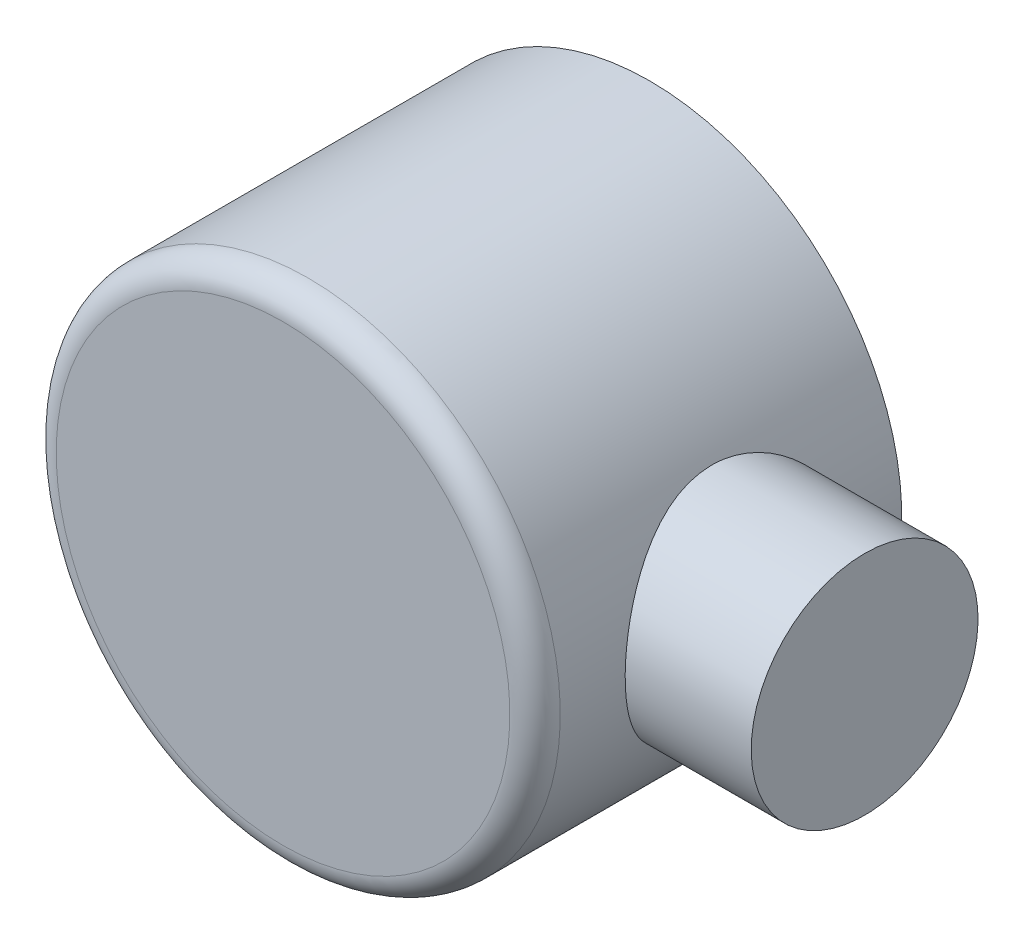
ISO-10303-21;
HEADER;
FILE_DESCRIPTION(('STEP AP214'),'2;1');
FILE_NAME('part.step','',(''),(''),'','','');
FILE_SCHEMA(('AUTOMOTIVE_DESIGN { 1 0 10303 214 1 1 1 1 }'));
ENDSEC;
DATA;
#1=APPLICATION_CONTEXT('core data for automotive mechanical design processes');
#2=APPLICATION_PROTOCOL_DEFINITION('international standard','automotive_design',2000,#1);
#3=PRODUCT_CONTEXT('',#1,'mechanical');
#4=PRODUCT('Part','Part','',(#3));
#5=PRODUCT_RELATED_PRODUCT_CATEGORY('part','',(#4));
#6=PRODUCT_DEFINITION_FORMATION('','',#4);
#7=PRODUCT_DEFINITION_CONTEXT('part definition',#1,'design');
#8=PRODUCT_DEFINITION('design','',#6,#7);
#9=PRODUCT_DEFINITION_SHAPE('','',#8);
#10=(LENGTH_UNIT() NAMED_UNIT(*) SI_UNIT(.MILLI.,.METRE.));
#11=(NAMED_UNIT(*) PLANE_ANGLE_UNIT() SI_UNIT($,.RADIAN.));
#12=(NAMED_UNIT(*) SI_UNIT($,.STERADIAN.) SOLID_ANGLE_UNIT());
#13=UNCERTAINTY_MEASURE_WITH_UNIT(LENGTH_MEASURE(1.E-05),#10,'distance_accuracy_value','');
#14=(GEOMETRIC_REPRESENTATION_CONTEXT(3) GLOBAL_UNCERTAINTY_ASSIGNED_CONTEXT((#13)) GLOBAL_UNIT_ASSIGNED_CONTEXT((#10,
#11,#12)) REPRESENTATION_CONTEXT('',''));
#15=CARTESIAN_POINT('',(0.,0.,0.));
#16=DIRECTION('',(0.,0.,1.));
#17=DIRECTION('',(1.,0.,0.));
#18=AXIS2_PLACEMENT_3D('',#15,#16,#17);
#19=CARTESIAN_POINT('',(0.,1.13019250938352E-13,-32.37));
#20=DIRECTION('',(0.,0.,1.));
#21=DIRECTION('',(0.,-1.,0.));
#22=AXIS2_PLACEMENT_3D('',#19,#20,#21);
#23=CYLINDRICAL_SURFACE('',#22,50.);
#24=CARTESIAN_POINT('',(0.,-1.2352860976827E-13,35.38));
#25=DIRECTION('',(0.,0.,1.));
#26=DIRECTION('',(0.,-1.,0.));
#27=AXIS2_PLACEMENT_3D('',#24,#25,#26);
#28=CIRCLE('',#27,50.);
#29=CARTESIAN_POINT('',(-1.74574066942157E-13,-50.0000000000001,35.3799999999998));
#30=VERTEX_POINT('',#29);
#31=EDGE_CURVE('E10',#30,#30,#28,.F.);
#32=ORIENTED_EDGE('',*,*,#31,.T.);
#33=EDGE_LOOP('',(#32));
#34=FACE_BOUND('',#33,.T.);
#35=CARTESIAN_POINT('',(0.,1.13019250938352E-13,-32.37));
#36=DIRECTION('',(0.,0.,-1.));
#37=DIRECTION('',(0.,1.,0.));
#38=AXIS2_PLACEMENT_3D('',#35,#36,#37);
#39=CIRCLE('',#38,50.);
#40=CARTESIAN_POINT('',(1.74574066942157E-13,50.0000000000001,-32.3699999999998));
#41=VERTEX_POINT('',#40);
#42=EDGE_CURVE('E51',#41,#41,#39,.T.);
#43=ORIENTED_EDGE('',*,*,#42,.F.);
#44=EDGE_LOOP('',(#43));
#45=FACE_BOUND('',#44,.T.);
#46=CARTESIAN_POINT('',(44.6514277487295,22.4999999999998,0.00500000000007662));
#47=CARTESIAN_POINT('',(44.6514331496879,22.4999952583879,0.6001139974423));
#48=CARTESIAN_POINT('',(44.6633665130597,22.4763557889527,1.19538052813286));
#49=CARTESIAN_POINT('',(44.7106933580069,22.3820594999056,2.38149178175206));
#50=CARTESIAN_POINT('',(44.7461005171107,22.3113752685245,2.97233372349624));
#51=CARTESIAN_POINT('',(44.8392259865932,22.1236252961562,4.14616305066861));
#52=CARTESIAN_POINT('',(44.8969934950232,22.0064572655523,4.72913016186927));
#53=CARTESIAN_POINT('',(45.0328466966896,21.7270978507883,5.8816319276094));
#54=CARTESIAN_POINT('',(45.1109296963427,21.5649124351876,6.45116835198231));
#55=CARTESIAN_POINT('',(45.2844893812101,21.1980179034671,7.57067648809387));
#56=CARTESIAN_POINT('',(45.3798852418786,20.9935057900856,8.12072548147503));
#57=CARTESIAN_POINT('',(45.5854408077569,20.5433387782115,9.20084704419589));
#58=CARTESIAN_POINT('',(45.6956009614955,20.2976826297355,9.73091900602037));
#59=CARTESIAN_POINT('',(45.9275507198874,19.7672406325962,10.7681493969769));
#60=CARTESIAN_POINT('',(46.0493357066166,19.4824703023339,11.2753168078876));
#61=CARTESIAN_POINT('',(46.3014323010887,18.8755229767186,12.2647565381917));
#62=CARTESIAN_POINT('',(46.4317470170341,18.5533323120391,12.7470196667449));
#63=CARTESIAN_POINT('',(46.7064434747224,17.8510362036207,13.7152658943292));
#64=CARTESIAN_POINT('',(46.8511859791585,17.4685117974004,14.19939357998));
#65=CARTESIAN_POINT('',(47.1428419781459,16.6653820379887,15.1342707823937));
#66=CARTESIAN_POINT('',(47.2897555673935,16.24477501962,15.5850188380509));
#67=CARTESIAN_POINT('',(47.5820862366567,15.3674636354331,16.4510075673683));
#68=CARTESIAN_POINT('',(47.7275023916807,14.9107383124857,16.8662273310209));
#69=CARTESIAN_POINT('',(48.0130575040857,13.9639078478759,17.6583320483906));
#70=CARTESIAN_POINT('',(48.1531982489097,13.4738141732537,18.0352300614742));
#71=CARTESIAN_POINT('',(48.4318803019623,12.4360940594796,18.7671292140427));
#72=CARTESIAN_POINT('',(48.5699529667438,11.8867985678765,19.1199479346266));
#73=CARTESIAN_POINT('',(48.8325746946265,10.7571323005264,19.7777415676559));
#74=CARTESIAN_POINT('',(48.9571231540959,10.1767601394457,20.0827143448424));
#75=CARTESIAN_POINT('',(49.1890641274939,8.9889885418119,20.6418294656366));
#76=CARTESIAN_POINT('',(49.2964634689313,8.3815999849459,20.8959920483071));
#77=CARTESIAN_POINT('',(49.4909639688973,7.14399759588546,21.3509091137665));
#78=CARTESIAN_POINT('',(49.5780668182679,6.51378567009727,21.5516680456561));
#79=CARTESIAN_POINT('',(49.7247989012833,5.27359395428634,21.8871153722321));
#80=CARTESIAN_POINT('',(49.7857544225265,4.66464137457279,22.0250241613071));
#81=CARTESIAN_POINT('',(49.8856349235185,3.43561453721536,22.2499264674727));
#82=CARTESIAN_POINT('',(49.9245607039376,2.81554068461892,22.3369218350138));
#83=CARTESIAN_POINT('',(49.9792486563951,1.56953348842912,22.4589143699431));
#84=CARTESIAN_POINT('',(49.9950202120803,0.94360262204927,22.4939326020205));
#85=CARTESIAN_POINT('',(50.0029670200099,-0.309134705431897,22.5115944030888));
#86=CARTESIAN_POINT('',(49.9951433753999,-0.935941124229051,22.4942404206361));
#87=CARTESIAN_POINT('',(49.9575213166338,-2.14086897990907,22.4104719215389));
#88=CARTESIAN_POINT('',(49.9293196437034,-2.71929238595779,22.3476216974709));
#89=CARTESIAN_POINT('',(49.8534653265025,-3.86825826610687,22.1775911674549));
#90=CARTESIAN_POINT('',(49.8058137853878,-4.43880118527486,22.0704133756693));
#91=CARTESIAN_POINT('',(49.6922279577864,-5.56818084712784,21.812816624326));
#92=CARTESIAN_POINT('',(49.6262930621142,-6.12701719909279,21.6623962239561));
#93=CARTESIAN_POINT('',(49.4777187230919,-7.22943622542148,21.3197476825414));
#94=CARTESIAN_POINT('',(49.3950787393625,-7.7730184056925,21.1275181890329));
#95=CARTESIAN_POINT('',(49.2136507927508,-8.84981312079243,20.6997216544798));
#96=CARTESIAN_POINT('',(49.1146374574499,-9.38274438436383,20.4635430001478));
#97=CARTESIAN_POINT('',(48.9036704000379,-10.4266302840965,19.9517620382356));
#98=CARTESIAN_POINT('',(48.7917166607274,-10.9375848910468,19.6761596782564));
#99=CARTESIAN_POINT('',(48.5573562256655,-11.9350627095441,19.0874464995484));
#100=CARTESIAN_POINT('',(48.4349467503387,-12.4215793695238,18.7743256978691));
#101=CARTESIAN_POINT('',(48.182388381628,-13.3677702153767,18.1126243928805));
#102=CARTESIAN_POINT('',(48.0522388781887,-13.8274422797314,17.764041092936));
#103=CARTESIAN_POINT('',(47.7763874896068,-14.7535960947942,17.0040713094692));
#104=CARTESIAN_POINT('',(47.6302756096262,-15.2176650998549,16.5898898807869));
#105=CARTESIAN_POINT('',(47.3360332184249,-16.1096422785546,15.7249056211661));
#106=CARTESIAN_POINT('',(47.1879026060146,-16.5375486317296,15.2741009488147));
#107=CARTESIAN_POINT('',(46.8934169516799,-17.3550067500785,14.3381741278008));
#108=CARTESIAN_POINT('',(46.7470624181388,-17.7445477505143,13.8530424127323));
#109=CARTESIAN_POINT('',(46.4600368011359,-18.483019863093,12.8508397494645));
#110=CARTESIAN_POINT('',(46.3193683683983,-18.8319321744577,12.3337541828131));
#111=CARTESIAN_POINT('',(46.0418201733764,-19.5009661749371,11.2471950373151));
#112=CARTESIAN_POINT('',(45.9053759444455,-19.8191584782835,10.6764189820961));
#113=CARTESIAN_POINT('',(45.6476770004516,-20.4056907627034,9.50686790165224));
#114=CARTESIAN_POINT('',(45.5264143803455,-20.6740567237436,8.90810767268446));
#115=CARTESIAN_POINT('',(45.3033650249911,-21.1583610061236,7.6864884026937));
#116=CARTESIAN_POINT('',(45.2015702305447,-21.3743210322224,7.06363946274048));
#117=CARTESIAN_POINT('',(45.0213292162712,-21.7514069668417,5.79827030116039));
#118=CARTESIAN_POINT('',(44.9428804905528,-21.9125387607134,5.15575219892845));
#119=CARTESIAN_POINT('',(44.8172381790679,-22.1683098240238,3.90306241453097));
#120=CARTESIAN_POINT('',(44.7682054742528,-22.2668913301111,3.29387886264717));
#121=CARTESIAN_POINT('',(44.6948737625393,-22.413724752398,2.0679943136415));
#122=CARTESIAN_POINT('',(44.6705735430875,-22.461979135976,1.45129368655769));
#123=CARTESIAN_POINT('',(44.6476546706894,-22.5075006114039,0.215779423894318));
#124=CARTESIAN_POINT('',(44.6490259643343,-22.5047876629414,-0.403033289636096));
#125=CARTESIAN_POINT('',(44.6773734090472,-22.448458884074,-1.63772873620178));
#126=CARTESIAN_POINT('',(44.7043484942555,-22.3948451726157,-2.25361159013149));
#127=CARTESIAN_POINT('',(44.7796955294752,-22.2437696806118,-3.42818037700751));
#128=CARTESIAN_POINT('',(44.8261772208932,-22.1501708393638,-3.98749094687315));
#129=CARTESIAN_POINT('',(44.938423718788,-21.921548189423,-5.0955603479581));
#130=CARTESIAN_POINT('',(45.00418727954,-21.7865270568334,-5.64431985839956));
#131=CARTESIAN_POINT('',(45.1530264541782,-21.4763532420438,-6.7280542382765));
#132=CARTESIAN_POINT('',(45.2361053548059,-21.3011929401284,-7.2630264689613));
#133=CARTESIAN_POINT('',(45.4172028651559,-20.9122848694384,-8.31614577415576));
#134=CARTESIAN_POINT('',(45.5152222614499,-20.6985350689349,-8.83429196108228));
#135=CARTESIAN_POINT('',(45.728260547932,-20.2236712803484,-9.87397869616262));
#136=CARTESIAN_POINT('',(45.8438447185864,-19.9608628975249,-10.3946291064304));
#137=CARTESIAN_POINT('',(46.0853754486528,-19.3967091749456,-11.4123716190786));
#138=CARTESIAN_POINT('',(46.2113265166119,-19.0953470363048,-11.9094533217702));
#139=CARTESIAN_POINT('',(46.4703652361595,-18.4560046554357,-12.8776430028998));
#140=CARTESIAN_POINT('',(46.6034541959507,-18.1180176891009,-13.3487461877948));
#141=CARTESIAN_POINT('',(46.8735498277732,-17.4073214191763,-14.2628084615385));
#142=CARTESIAN_POINT('',(47.0105567117106,-17.0346102350101,-14.7057660239033));
#143=CARTESIAN_POINT('',(47.2988026759642,-16.2181543793273,-15.603482799758));
#144=CARTESIAN_POINT('',(47.4501211820035,-15.7710278673028,-16.0551472915082));
#145=CARTESIAN_POINT('',(47.749617114544,-14.8395884000633,-16.919548731584));
#146=CARTESIAN_POINT('',(47.8977943414636,-14.3552730910341,-17.3322832121973));
#147=CARTESIAN_POINT('',(48.187103587636,-13.3519893170105,-18.1162504555153));
#148=CARTESIAN_POINT('',(48.3282342996468,-12.8330144635496,-18.4874755332742));
#149=CARTESIAN_POINT('',(48.5996615901571,-11.7633876793883,-19.1856374170121));
#150=CARTESIAN_POINT('',(48.7299583748752,-11.2127363519721,-19.5125750660554));
#151=CARTESIAN_POINT('',(48.9774286438632,-10.07732129051,-20.1225190363469));
#152=CARTESIAN_POINT('',(49.0944567902227,-9.49226992195441,-20.4050499009174));
#153=CARTESIAN_POINT('',(49.310523798494,-8.29704696579395,-20.9194418059624));
#154=CARTESIAN_POINT('',(49.4095623250299,-7.68687491013063,-21.1513019018112));
#155=CARTESIAN_POINT('',(49.5866720658667,-6.44626262572875,-21.5616945235676));
#156=CARTESIAN_POINT('',(49.6647553818098,-5.81583433155675,-21.7402578351021));
#157=CARTESIAN_POINT('',(49.7976369884757,-4.53947850821805,-22.0420645058057));
#158=CARTESIAN_POINT('',(49.8524373999993,-3.89355239638643,-22.165312903575));
#159=CARTESIAN_POINT('',(49.9336934327468,-2.64332248451885,-22.3473999698042));
#160=CARTESIAN_POINT('',(49.9620484553705,-2.03976842536934,-22.4105627722743));
#161=CARTESIAN_POINT('',(49.9967964567917,-0.828911381760753,-22.4879072102452));
#162=CARTESIAN_POINT('',(50.0031906533693,-0.221608607047844,-22.502091561718));
#163=CARTESIAN_POINT('',(49.9938429191589,0.991853178335956,-22.4813159921261));
#164=CARTESIAN_POINT('',(49.978105492419,1.5980123965973,-22.4463660704702));
#165=CARTESIAN_POINT('',(49.9249336551635,2.80457423824752,-22.327751995236));
#166=CARTESIAN_POINT('',(49.8874995236469,3.40497693555886,-22.2440884680684));
#167=CARTESIAN_POINT('',(49.7941697701089,4.56782460955251,-22.0340049379889));
#168=CARTESIAN_POINT('',(49.7392113885207,5.13073815469204,-21.9097490359808));
#169=CARTESIAN_POINT('',(49.6118161334864,6.24350161426302,-21.6190459597331));
#170=CARTESIAN_POINT('',(49.5393799722206,6.79335205998387,-21.4526005046091));
#171=CARTESIAN_POINT('',(49.3787128741001,7.87671636987201,-21.079015500221));
#172=CARTESIAN_POINT('',(49.2904802452654,8.41022847684296,-20.8718715914611));
#173=CARTESIAN_POINT('',(49.1002233047799,9.45788432032155,-20.4186192660482));
#174=CARTESIAN_POINT('',(48.9981983891149,9.97202720731928,-20.1725091428429));
#175=CARTESIAN_POINT('',(48.7776616886366,11.001330663733,-19.6310430294166));
#176=CARTESIAN_POINT('',(48.658609026905,11.5154607112035,-19.3339486145547));
#177=CARTESIAN_POINT('',(48.4106550752119,12.5169750096419,-18.7013143405815));
#178=CARTESIAN_POINT('',(48.2817535603456,13.0043586494019,-18.365773603437));
#179=CARTESIAN_POINT('',(48.0170393436995,13.9500934021882,-17.6583423786395));
#180=CARTESIAN_POINT('',(47.88122566509,14.4084403910835,-17.2864467464224));
#181=CARTESIAN_POINT('',(47.6057351885172,15.2940899224716,-16.5082821103204));
#182=CARTESIAN_POINT('',(47.4660566045746,15.7213777701757,-16.1019970302378));
#183=CARTESIAN_POINT('',(47.1747494629754,16.5759760076511,-15.2230187364355));
#184=CARTESIAN_POINT('',(47.023069656476,17.0004830523435,-14.747612085764));
#185=CARTESIAN_POINT('',(46.7232457299803,17.8079692466722,-13.7620591711424));
#186=CARTESIAN_POINT('',(46.5751001782361,18.1909654433051,-13.2519273087678));
#187=CARTESIAN_POINT('',(46.2863958789954,18.9135160948016,-12.1989731091516));
#188=CARTESIAN_POINT('',(46.1458443697358,19.2530295122343,-11.6561205915028));
#189=CARTESIAN_POINT('',(45.8767837837083,19.8856458323682,-10.5411775844292));
#190=CARTESIAN_POINT('',(45.7482739954165,20.1787514779299,-9.96908882561333));
#191=CARTESIAN_POINT('',(45.5067720567175,20.717661251492,-8.79545353677709));
#192=CARTESIAN_POINT('',(45.3938796662391,20.963164979449,-8.19374818038871));
#193=CARTESIAN_POINT('',(45.1885910297306,21.4021038459481,-6.96806770741967));
#194=CARTESIAN_POINT('',(45.0961982810756,21.595530100927,-6.34408881187308));
#195=CARTESIAN_POINT('',(44.9357559150861,21.9274204377831,-5.08062937155454));
#196=CARTESIAN_POINT('',(44.8676345112643,22.0660467349731,-4.44120061494229));
#197=CARTESIAN_POINT('',(44.7581999798554,22.2871920625683,-3.15078654810824));
#198=CARTESIAN_POINT('',(44.7168668483322,22.3697529615846,-2.49981023501294));
#199=CARTESIAN_POINT('',(44.6770338325143,22.449126397575,-1.53843225247752));
#200=CARTESIAN_POINT('',(44.6674421782835,22.4681953339587,-1.23015609877819));
#201=CARTESIAN_POINT('',(44.6546376326114,22.4936335685312,-0.612933683851554));
#202=CARTESIAN_POINT('',(44.6514249445136,22.5000024618783,-0.303987401576692));
#203=CARTESIAN_POINT('',(44.6514277487295,22.4999999999998,0.00500000000007662));
#204=B_SPLINE_CURVE_WITH_KNOTS('',3,(#46,#47,#48,#49,#50,#51,#52,#53,#54,#55,#56,#57,#58,#59,
#60,#61,#62,#63,#64,#65,#66,#67,#68,#69,#70,#71,#72,#73,#74,#75,#76,#77,#78,#79,#80,#81,#82,#83,
#84,#85,#86,#87,#88,#89,#90,#91,#92,#93,#94,#95,#96,#97,#98,#99,#100,#101,#102,#103,#104,#105,
#106,#107,#108,#109,#110,#111,#112,#113,#114,#115,#116,#117,#118,#119,#120,#121,#122,#123,#124,
#125,#126,#127,#128,#129,#130,#131,#132,#133,#134,#135,#136,#137,#138,#139,#140,#141,#142,#143,
#144,#145,#146,#147,#148,#149,#150,#151,#152,#153,#154,#155,#156,#157,#158,#159,#160,#161,#162,
#163,#164,#165,#166,#167,#168,#169,#170,#171,#172,#173,#174,#175,#176,#177,#178,#179,#180,#181,
#182,#183,#184,#185,#186,#187,#188,#189,#190,#191,#192,#193,#194,#195,#196,#197,#198,#199,#200,
#201,#202,#203),.UNSPECIFIED.,.T.,.F.,(4,2,2,2,2,2,2,2,2,2,2,2,2,2,2,2,2,2,2,2,2,2,2,2,2,2,2,2,
2,2,2,2,2,2,2,2,2,2,2,2,2,2,2,2,2,2,2,2,2,2,2,2,2,2,2,2,2,2,2,2,2,2,2,2,2,2,2,2,2,2,2,2,2,2,2,2,
2,2,4),(0.,1.78502228101075,3.5710855600815,5.36110114528743,7.15087951734702,8.93250779772909,
10.7141902150003,12.4951677875387,14.2767979942674,16.1760215385033,18.0753281671853,
19.9757450433215,21.8755121053838,23.87483164112,25.8742403767076,27.8728511003224,
29.8712952658951,31.7508351195164,33.6303066569413,35.5090162958214,37.3876381008119,
39.1331142790294,40.8784914712466,42.6239268249018,44.3694186492618,46.141316079259,
47.9132158643496,49.6855881699536,51.4581003564699,53.3728276905835,55.287651356641,
57.2030107717301,59.1192530194986,61.1193940408643,63.1184892212501,65.1167550257446,
67.1148062654396,68.9694551915332,70.8240131858321,72.6778449183343,74.5315994811089,
76.2366306678999,77.9415517236809,79.6467966972433,81.3521314777852,83.1339549671409,
84.9165575051465,86.6994878749465,88.4825148599682,90.4402100013184,92.3980291546171,
94.3562101755475,96.3143539149071,98.2922128717674,100.270108697562,102.246859817721,
104.223430840317,106.04363457567,107.863737374763,109.683469814916,111.503178855557,
113.238450651992,114.973651751936,116.709038822833,118.44450191725,120.259398174572,
122.074335888574,123.889530806369,125.70557901861,127.668772673634,129.631157037027,
131.59537998837,133.55948680395,135.535611508564,137.512073094395,139.482639471522,
141.451732642735,142.378499308844,143.305295517195),.UNSPECIFIED.);
#205=CARTESIAN_POINT('',(44.6514277487295,22.4999999999998,0.00500000000007662));
#206=VERTEX_POINT('',#205);
#207=EDGE_CURVE('E47',#206,#206,#204,.T.);
#208=ORIENTED_EDGE('',*,*,#207,.F.);
#209=EDGE_LOOP('',(#208));
#210=FACE_BOUND('',#209,.T.);
#211=ADVANCED_FACE('F36',(#34,#45,#210),#23,.T.);
#212=CARTESIAN_POINT('',(0.,1.13019250938352E-13,-32.37));
#213=DIRECTION('',(0.,0.,-1.));
#214=DIRECTION('',(0.,1.,0.));
#215=AXIS2_PLACEMENT_3D('',#212,#213,#214);
#216=PLANE('',#215);
#217=CARTESIAN_POINT('',(0.,1.13019250938352E-13,-32.37));
#218=DIRECTION('',(0.,0.,-1.));
#219=DIRECTION('',(0.,1.,0.));
#220=AXIS2_PLACEMENT_3D('',#217,#218,#219);
#221=CIRCLE('',#220,42.5);
#222=CARTESIAN_POINT('',(0.,42.5000000000001,-32.3699999999999));
#223=VERTEX_POINT('',#222);
#224=EDGE_CURVE('E77',#223,#223,#221,.T.);
#225=ORIENTED_EDGE('',*,*,#224,.F.);
#226=EDGE_LOOP('',(#225));
#227=FACE_BOUND('',#226,.T.);
#228=ORIENTED_EDGE('',*,*,#42,.T.);
#229=EDGE_LOOP('',(#228));
#230=FACE_BOUND('',#229,.T.);
#231=ADVANCED_FACE('F66',(#227,#230),#216,.T.);
#232=CARTESIAN_POINT('',(50.,-1.74591524348851E-13,0.00499999999999806));
#233=DIRECTION('',(-1.,0.,0.));
#234=DIRECTION('',(0.,1.,0.));
#235=AXIS2_PLACEMENT_3D('',#232,#233,#234);
#236=CYLINDRICAL_SURFACE('',#235,22.5);
#237=CARTESIAN_POINT('',(75.,-2.61878557819929E-13,0.00499999999999806));
#238=DIRECTION('',(-1.,0.,0.));
#239=DIRECTION('',(0.,1.,0.));
#240=AXIS2_PLACEMENT_3D('',#237,#238,#239);
#241=CIRCLE('',#240,22.5);
#242=CARTESIAN_POINT('',(75.0000000000001,22.4999999999997,0.00500000000007662));
#243=VERTEX_POINT('',#242);
#244=EDGE_CURVE('E81',#243,#243,#241,.T.);
#245=ORIENTED_EDGE('',*,*,#244,.T.);
#246=EDGE_LOOP('',(#245));
#247=FACE_BOUND('',#246,.T.);
#248=ORIENTED_EDGE('',*,*,#207,.T.);
#249=EDGE_LOOP('',(#248));
#250=FACE_BOUND('',#249,.T.);
#251=ADVANCED_FACE('F61',(#247,#250),#236,.T.);
#252=CARTESIAN_POINT('',(75.,-2.61878557819929E-13,0.00499999999999806));
#253=DIRECTION('',(-1.,0.,0.));
#254=DIRECTION('',(0.,1.,0.));
#255=AXIS2_PLACEMENT_3D('',#252,#253,#254);
#256=PLANE('',#255);
#257=ORIENTED_EDGE('',*,*,#244,.F.);
#258=EDGE_LOOP('',(#257));
#259=FACE_BOUND('',#258,.T.);
#260=ADVANCED_FACE('F65',(#259),#256,.F.);
#261=CARTESIAN_POINT('',(0.,-1.40986016462486E-13,40.38));
#262=DIRECTION('',(0.,0.,1.));
#263=DIRECTION('',(0.,-1.,0.));
#264=AXIS2_PLACEMENT_3D('',#261,#262,#263);
#265=PLANE('',#264);
#266=CARTESIAN_POINT('',(0.,-1.40986016462486E-13,40.38));
#267=DIRECTION('',(0.,0.,1.));
#268=DIRECTION('',(0.,-1.,0.));
#269=AXIS2_PLACEMENT_3D('',#266,#267,#268);
#270=CIRCLE('',#269,45.);
#271=CARTESIAN_POINT('',(-1.57116660247942E-13,-45.0000000000001,40.3799999999998));
#272=VERTEX_POINT('',#271);
#273=EDGE_CURVE('E43',#272,#272,#270,.T.);
#274=ORIENTED_EDGE('',*,*,#273,.T.);
#275=EDGE_LOOP('',(#274));
#276=FACE_BOUND('',#275,.T.);
#277=ADVANCED_FACE('F100',(#276),#265,.T.);
#278=CARTESIAN_POINT('',(0.,-1.2352860976827E-13,35.38));
#279=DIRECTION('',(0.,0.,1.));
#280=DIRECTION('',(0.,-1.,0.));
#281=AXIS2_PLACEMENT_3D('',#278,#279,#280);
#282=TOROIDAL_SURFACE('',#281,45.,5.);
#283=ORIENTED_EDGE('',*,*,#31,.F.);
#284=EDGE_LOOP('',(#283));
#285=FACE_BOUND('',#284,.T.);
#286=ORIENTED_EDGE('',*,*,#273,.F.);
#287=EDGE_LOOP('',(#286));
#288=FACE_BOUND('',#287,.T.);
#289=ADVANCED_FACE('F38',(#285,#288),#282,.T.);
#290=CARTESIAN_POINT('',(0.,0.,27.63));
#291=DIRECTION('',(0.,0.,-1.));
#292=DIRECTION('',(0.,1.,0.));
#293=AXIS2_PLACEMENT_3D('',#290,#291,#292);
#294=CYLINDRICAL_SURFACE('',#293,42.5);
#295=CARTESIAN_POINT('',(0.,0.,27.63));
#296=DIRECTION('',(0.,0.,-1.));
#297=DIRECTION('',(0.,1.,0.));
#298=AXIS2_PLACEMENT_3D('',#295,#296,#297);
#299=CIRCLE('',#298,42.5);
#300=CARTESIAN_POINT('',(0.,42.4999999999999,27.6300000000001));
#301=VERTEX_POINT('',#300);
#302=EDGE_CURVE('E83',#301,#301,#299,.T.);
#303=ORIENTED_EDGE('',*,*,#302,.F.);
#304=EDGE_LOOP('',(#303));
#305=FACE_BOUND('',#304,.T.);
#306=ORIENTED_EDGE('',*,*,#224,.T.);
#307=EDGE_LOOP('',(#306));
#308=FACE_BOUND('',#307,.T.);
#309=ADVANCED_FACE('F89',(#305,#308),#294,.F.);
#310=CARTESIAN_POINT('',(0.,0.,27.63));
#311=DIRECTION('',(0.,0.,-1.));
#312=DIRECTION('',(0.,1.,0.));
#313=AXIS2_PLACEMENT_3D('',#310,#311,#312);
#314=PLANE('',#313);
#315=ORIENTED_EDGE('',*,*,#302,.T.);
#316=EDGE_LOOP('',(#315));
#317=FACE_BOUND('',#316,.T.);
#318=ADVANCED_FACE('F91',(#317),#314,.T.);
#319=CLOSED_SHELL('',(#211,#231,#251,#260,#277,#289,#309,#318));
#320=MANIFOLD_SOLID_BREP('B2',#319);
#321=ADVANCED_BREP_SHAPE_REPRESENTATION('',(#18,#320),#14);
#322=SHAPE_DEFINITION_REPRESENTATION(#9,#321);
ENDSEC;
END-ISO-10303-21;
